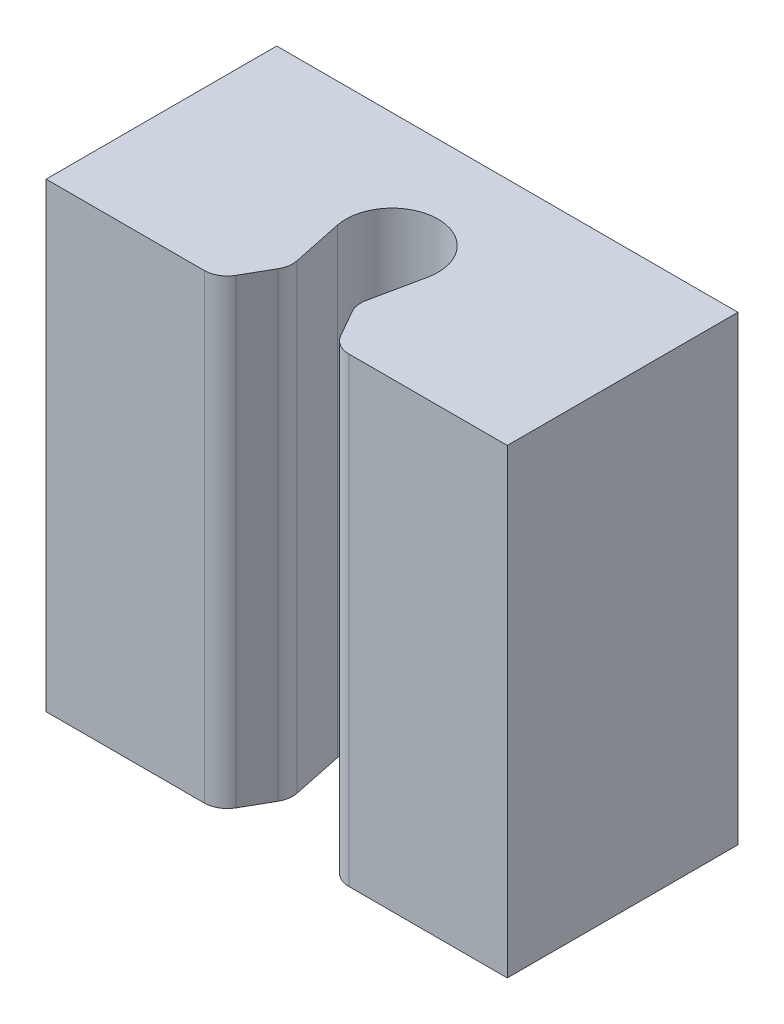
ISO-10303-21;
HEADER;
FILE_DESCRIPTION(('STEP AP214'),'2;1');
FILE_NAME('part.step','',(''),(''),'','','');
FILE_SCHEMA(('AUTOMOTIVE_DESIGN { 1 0 10303 214 1 1 1 1 }'));
ENDSEC;
DATA;
#1=APPLICATION_CONTEXT('core data for automotive mechanical design processes');
#2=APPLICATION_PROTOCOL_DEFINITION('international standard','automotive_design',2000,#1);
#3=PRODUCT_CONTEXT('',#1,'mechanical');
#4=PRODUCT('Part','Part','',(#3));
#5=PRODUCT_RELATED_PRODUCT_CATEGORY('part','',(#4));
#6=PRODUCT_DEFINITION_FORMATION('','',#4);
#7=PRODUCT_DEFINITION_CONTEXT('part definition',#1,'design');
#8=PRODUCT_DEFINITION('design','',#6,#7);
#9=PRODUCT_DEFINITION_SHAPE('','',#8);
#10=(LENGTH_UNIT() NAMED_UNIT(*) SI_UNIT(.MILLI.,.METRE.));
#11=(NAMED_UNIT(*) PLANE_ANGLE_UNIT() SI_UNIT($,.RADIAN.));
#12=(NAMED_UNIT(*) SI_UNIT($,.STERADIAN.) SOLID_ANGLE_UNIT());
#13=UNCERTAINTY_MEASURE_WITH_UNIT(LENGTH_MEASURE(1.E-05),#10,'distance_accuracy_value','');
#14=(GEOMETRIC_REPRESENTATION_CONTEXT(3) GLOBAL_UNCERTAINTY_ASSIGNED_CONTEXT((#13)) GLOBAL_UNIT_ASSIGNED_CONTEXT((#10,
#11,#12)) REPRESENTATION_CONTEXT('',''));
#15=CARTESIAN_POINT('',(0.,0.,0.));
#16=DIRECTION('',(0.,0.,1.));
#17=DIRECTION('',(1.,0.,0.));
#18=AXIS2_PLACEMENT_3D('',#15,#16,#17);
#19=CARTESIAN_POINT('',(50.,-50.,50.));
#20=DIRECTION('',(0.,1.,0.));
#21=DIRECTION('',(-1.,0.,0.));
#22=AXIS2_PLACEMENT_3D('',#19,#20,#21);
#23=PLANE('',#22);
#24=DIRECTION('',(1.,0.,0.));
#25=VECTOR('',#24,1.);
#26=CARTESIAN_POINT('',(50.,-50.,50.));
#27=LINE('',#26,#25);
#28=CARTESIAN_POINT('',(15.6943456664814,-50.,50.));
#29=VERTEX_POINT('',#28);
#30=CARTESIAN_POINT('',(50.,-50.,50.));
#31=VERTEX_POINT('',#30);
#32=EDGE_CURVE('E186',#29,#31,#27,.T.);
#33=ORIENTED_EDGE('',*,*,#32,.F.);
#34=CARTESIAN_POINT('',(15.6943456664814,-50.,45.));
#35=DIRECTION('',(0.,1.,0.));
#36=DIRECTION('',(-1.,0.,0.));
#37=AXIS2_PLACEMENT_3D('',#34,#35,#36);
#38=CIRCLE('',#37,5.);
#39=CARTESIAN_POINT('',(11.3512143479432,-50.,47.4773393691484));
#40=VERTEX_POINT('',#39);
#41=EDGE_CURVE('E225',#29,#40,#38,.F.);
#42=ORIENTED_EDGE('',*,*,#41,.T.);
#43=DIRECTION('',(-0.495467873829664,0.,-0.86862626370765));
#44=VECTOR('',#43,1.);
#45=CARTESIAN_POINT('',(-11.8685040398792,-50.,6.76984188467605));
#46=LINE('',#45,#44);
#47=CARTESIAN_POINT('',(8.0242982021265,-50.,41.6447780790033));
#48=VERTEX_POINT('',#47);
#49=EDGE_CURVE('E165',#40,#48,#46,.T.);
#50=ORIENTED_EDGE('',*,*,#49,.T.);
#51=CARTESIAN_POINT('',(12.3674295206647,-50.,39.167438709855));
#52=DIRECTION('',(0.,1.,0.));
#53=DIRECTION('',(-1.,0.,0.));
#54=AXIS2_PLACEMENT_3D('',#51,#52,#53);
#55=CIRCLE('',#54,5.);
#56=CARTESIAN_POINT('',(7.47279898237299,-50.,38.1463648175133));
#57=VERTEX_POINT('',#56);
#58=EDGE_CURVE('E223',#48,#57,#55,.F.);
#59=ORIENTED_EDGE('',*,*,#58,.T.);
#60=DIRECTION('',(0.20421477846833,0.,-0.978926107658352));
#61=VECTOR('',#60,1.);
#62=CARTESIAN_POINT('',(14.7870405318914,-50.,3.08473967830502));
#63=LINE('',#62,#61);
#64=CARTESIAN_POINT('',(9.78926107658353,-50.,27.0421477846833));
#65=VERTEX_POINT('',#64);
#66=EDGE_CURVE('E177',#57,#65,#63,.T.);
#67=ORIENTED_EDGE('',*,*,#66,.T.);
#68=CARTESIAN_POINT('',(0.,-50.,25.));
#69=DIRECTION('',(0.,-1.,0.));
#70=DIRECTION('',(1.,0.,0.));
#71=AXIS2_PLACEMENT_3D('',#68,#69,#70);
#72=CIRCLE('',#71,10.);
#73=CARTESIAN_POINT('',(-9.78926107658352,-50.,27.0421477846833));
#74=VERTEX_POINT('',#73);
#75=EDGE_CURVE('E175',#74,#65,#72,.T.);
#76=ORIENTED_EDGE('',*,*,#75,.F.);
#77=DIRECTION('',(0.20421477846833,0.,0.978926107658352));
#78=VECTOR('',#77,1.);
#79=CARTESIAN_POINT('',(-14.7870405318914,-50.,3.08473967830503));
#80=LINE('',#79,#78);
#81=CARTESIAN_POINT('',(-7.47279898237298,-50.,38.1463648175133));
#82=VERTEX_POINT('',#81);
#83=EDGE_CURVE('E146',#74,#82,#80,.T.);
#84=ORIENTED_EDGE('',*,*,#83,.T.);
#85=CARTESIAN_POINT('',(-12.3674295206647,-50.,39.167438709855));
#86=DIRECTION('',(0.,1.,0.));
#87=DIRECTION('',(-1.,0.,0.));
#88=AXIS2_PLACEMENT_3D('',#85,#86,#87);
#89=CIRCLE('',#88,5.);
#90=CARTESIAN_POINT('',(-8.02429820212648,-50.,41.6447780790033));
#91=VERTEX_POINT('',#90);
#92=EDGE_CURVE('E219',#82,#91,#89,.F.);
#93=ORIENTED_EDGE('',*,*,#92,.T.);
#94=DIRECTION('',(-0.495467873829664,0.,0.86862626370765));
#95=VECTOR('',#94,1.);
#96=CARTESIAN_POINT('',(11.8685040398792,-50.,6.76984188467604));
#97=LINE('',#96,#95);
#98=CARTESIAN_POINT('',(-11.3512143479431,-50.,47.4773393691483));
#99=VERTEX_POINT('',#98);
#100=EDGE_CURVE('E171',#91,#99,#97,.T.);
#101=ORIENTED_EDGE('',*,*,#100,.T.);
#102=CARTESIAN_POINT('',(-15.6943456664814,-50.,45.));
#103=DIRECTION('',(0.,1.,0.));
#104=DIRECTION('',(-1.,0.,0.));
#105=AXIS2_PLACEMENT_3D('',#102,#103,#104);
#106=CIRCLE('',#105,5.);
#107=CARTESIAN_POINT('',(-15.6943456664814,-50.,50.));
#108=VERTEX_POINT('',#107);
#109=EDGE_CURVE('E221',#99,#108,#106,.F.);
#110=ORIENTED_EDGE('',*,*,#109,.T.);
#111=CARTESIAN_POINT('',(-50.,-50.,50.));
#112=VERTEX_POINT('',#111);
#113=EDGE_CURVE('E188',#112,#108,#27,.T.);
#114=ORIENTED_EDGE('',*,*,#113,.F.);
#115=DIRECTION('',(0.,0.,-1.));
#116=VECTOR('',#115,1.);
#117=CARTESIAN_POINT('',(-50.,-50.,50.));
#118=LINE('',#117,#116);
#119=CARTESIAN_POINT('',(-50.,-50.,0.));
#120=VERTEX_POINT('',#119);
#121=EDGE_CURVE('E213',#112,#120,#118,.T.);
#122=ORIENTED_EDGE('',*,*,#121,.T.);
#123=DIRECTION('',(1.,0.,0.));
#124=VECTOR('',#123,1.);
#125=CARTESIAN_POINT('',(50.,-50.,0.));
#126=LINE('',#125,#124);
#127=CARTESIAN_POINT('',(50.,-50.,0.));
#128=VERTEX_POINT('',#127);
#129=EDGE_CURVE('E200',#120,#128,#126,.T.);
#130=ORIENTED_EDGE('',*,*,#129,.T.);
#131=DIRECTION('',(0.,0.,-1.));
#132=VECTOR('',#131,1.);
#133=CARTESIAN_POINT('',(50.,-50.,50.));
#134=LINE('',#133,#132);
#135=EDGE_CURVE('E210',#31,#128,#134,.T.);
#136=ORIENTED_EDGE('',*,*,#135,.F.);
#137=EDGE_LOOP('',(#33,#42,#50,#59,#67,#76,#84,#93,#101,#110,#114,#122,#130,#136));
#138=FACE_BOUND('',#137,.T.);
#139=ADVANCED_FACE('F37',(#138),#23,.F.);
#140=CARTESIAN_POINT('',(50.,50.,50.));
#141=DIRECTION('',(0.,-1.,0.));
#142=DIRECTION('',(1.,0.,0.));
#143=AXIS2_PLACEMENT_3D('',#140,#141,#142);
#144=PLANE('',#143);
#145=DIRECTION('',(-0.495467873829664,0.,-0.86862626370765));
#146=VECTOR('',#145,1.);
#147=CARTESIAN_POINT('',(-11.8685040398792,50.,6.76984188467605));
#148=LINE('',#147,#146);
#149=CARTESIAN_POINT('',(11.3512143479431,50.,47.4773393691484));
#150=VERTEX_POINT('',#149);
#151=CARTESIAN_POINT('',(8.02429820212648,50.,41.6447780790033));
#152=VERTEX_POINT('',#151);
#153=EDGE_CURVE('E151',#150,#152,#148,.T.);
#154=ORIENTED_EDGE('',*,*,#153,.F.);
#155=CARTESIAN_POINT('',(15.6943456664814,50.,45.));
#156=DIRECTION('',(0.,-1.,0.));
#157=DIRECTION('',(1.,0.,0.));
#158=AXIS2_PLACEMENT_3D('',#155,#156,#157);
#159=CIRCLE('',#158,5.);
#160=CARTESIAN_POINT('',(15.6943456664814,50.,50.));
#161=VERTEX_POINT('',#160);
#162=EDGE_CURVE('E237',#150,#161,#159,.F.);
#163=ORIENTED_EDGE('',*,*,#162,.T.);
#164=DIRECTION('',(-1.,0.,0.));
#165=VECTOR('',#164,1.);
#166=CARTESIAN_POINT('',(50.,50.,50.));
#167=LINE('',#166,#165);
#168=CARTESIAN_POINT('',(50.,50.,50.));
#169=VERTEX_POINT('',#168);
#170=EDGE_CURVE('E194',#169,#161,#167,.T.);
#171=ORIENTED_EDGE('',*,*,#170,.F.);
#172=DIRECTION('',(0.,0.,-1.));
#173=VECTOR('',#172,1.);
#174=CARTESIAN_POINT('',(50.,50.,50.));
#175=LINE('',#174,#173);
#176=CARTESIAN_POINT('',(50.,50.,0.));
#177=VERTEX_POINT('',#176);
#178=EDGE_CURVE('E207',#169,#177,#175,.T.);
#179=ORIENTED_EDGE('',*,*,#178,.T.);
#180=DIRECTION('',(-1.,0.,0.));
#181=VECTOR('',#180,1.);
#182=CARTESIAN_POINT('',(50.,50.,0.));
#183=LINE('',#182,#181);
#184=CARTESIAN_POINT('',(-50.,50.,0.));
#185=VERTEX_POINT('',#184);
#186=EDGE_CURVE('E187',#177,#185,#183,.T.);
#187=ORIENTED_EDGE('',*,*,#186,.T.);
#188=DIRECTION('',(0.,0.,-1.));
#189=VECTOR('',#188,1.);
#190=CARTESIAN_POINT('',(-50.,50.,50.));
#191=LINE('',#190,#189);
#192=CARTESIAN_POINT('',(-50.,50.,50.));
#193=VERTEX_POINT('',#192);
#194=EDGE_CURVE('E197',#193,#185,#191,.T.);
#195=ORIENTED_EDGE('',*,*,#194,.F.);
#196=CARTESIAN_POINT('',(-15.6943456664814,50.,50.));
#197=VERTEX_POINT('',#196);
#198=EDGE_CURVE('E193',#197,#193,#167,.T.);
#199=ORIENTED_EDGE('',*,*,#198,.F.);
#200=CARTESIAN_POINT('',(-15.6943456664814,50.,45.));
#201=DIRECTION('',(0.,-1.,0.));
#202=DIRECTION('',(1.,0.,0.));
#203=AXIS2_PLACEMENT_3D('',#200,#201,#202);
#204=CIRCLE('',#203,5.);
#205=CARTESIAN_POINT('',(-11.3512143479432,50.,47.4773393691483));
#206=VERTEX_POINT('',#205);
#207=EDGE_CURVE('E233',#197,#206,#204,.F.);
#208=ORIENTED_EDGE('',*,*,#207,.T.);
#209=DIRECTION('',(-0.495467873829664,0.,0.86862626370765));
#210=VECTOR('',#209,1.);
#211=CARTESIAN_POINT('',(11.8685040398792,50.,6.76984188467604));
#212=LINE('',#211,#210);
#213=CARTESIAN_POINT('',(-8.0242982021265,50.,41.6447780790033));
#214=VERTEX_POINT('',#213);
#215=EDGE_CURVE('E162',#214,#206,#212,.T.);
#216=ORIENTED_EDGE('',*,*,#215,.F.);
#217=CARTESIAN_POINT('',(-12.3674295206647,50.,39.167438709855));
#218=DIRECTION('',(0.,-1.,0.));
#219=DIRECTION('',(1.,0.,0.));
#220=AXIS2_PLACEMENT_3D('',#217,#218,#219);
#221=CIRCLE('',#220,5.);
#222=CARTESIAN_POINT('',(-7.47279898237299,50.,38.1463648175133));
#223=VERTEX_POINT('',#222);
#224=EDGE_CURVE('E60',#214,#223,#221,.F.);
#225=ORIENTED_EDGE('',*,*,#224,.T.);
#226=DIRECTION('',(0.20421477846833,0.,0.978926107658352));
#227=VECTOR('',#226,1.);
#228=CARTESIAN_POINT('',(-14.7870405318914,50.,3.08473967830503));
#229=LINE('',#228,#227);
#230=CARTESIAN_POINT('',(-9.78926107658353,50.,27.0421477846833));
#231=VERTEX_POINT('',#230);
#232=EDGE_CURVE('E143',#231,#223,#229,.T.);
#233=ORIENTED_EDGE('',*,*,#232,.F.);
#234=CARTESIAN_POINT('',(0.,50.,25.));
#235=DIRECTION('',(0.,-1.,0.));
#236=DIRECTION('',(1.,0.,0.));
#237=AXIS2_PLACEMENT_3D('',#234,#235,#236);
#238=CIRCLE('',#237,10.);
#239=CARTESIAN_POINT('',(9.78926107658352,50.,27.0421477846833));
#240=VERTEX_POINT('',#239);
#241=EDGE_CURVE('E155',#231,#240,#238,.T.);
#242=ORIENTED_EDGE('',*,*,#241,.T.);
#243=DIRECTION('',(0.20421477846833,0.,-0.978926107658352));
#244=VECTOR('',#243,1.);
#245=CARTESIAN_POINT('',(14.7870405318914,50.,3.08473967830502));
#246=LINE('',#245,#244);
#247=CARTESIAN_POINT('',(7.47279898237298,50.,38.1463648175133));
#248=VERTEX_POINT('',#247);
#249=EDGE_CURVE('E158',#248,#240,#246,.T.);
#250=ORIENTED_EDGE('',*,*,#249,.F.);
#251=CARTESIAN_POINT('',(12.3674295206647,50.,39.167438709855));
#252=DIRECTION('',(0.,-1.,0.));
#253=DIRECTION('',(1.,0.,0.));
#254=AXIS2_PLACEMENT_3D('',#251,#252,#253);
#255=CIRCLE('',#254,5.);
#256=EDGE_CURVE('E235',#248,#152,#255,.F.);
#257=ORIENTED_EDGE('',*,*,#256,.T.);
#258=EDGE_LOOP('',(#154,#163,#171,#179,#187,#195,#199,#208,#216,#225,#233,#242,#250,#257));
#259=FACE_BOUND('',#258,.T.);
#260=ADVANCED_FACE('F161',(#259),#144,.F.);
#261=CARTESIAN_POINT('',(0.,0.,50.));
#262=DIRECTION('',(0.,0.,-1.));
#263=DIRECTION('',(-1.,0.,0.));
#264=AXIS2_PLACEMENT_3D('',#261,#262,#263);
#265=PLANE('',#264);
#266=ORIENTED_EDGE('',*,*,#170,.T.);
#267=DIRECTION('',(0.,-1.,0.));
#268=VECTOR('',#267,1.);
#269=CARTESIAN_POINT('',(15.6943456664814,-50.,50.));
#270=LINE('',#269,#268);
#271=EDGE_CURVE('E216',#161,#29,#270,.T.);
#272=ORIENTED_EDGE('',*,*,#271,.T.);
#273=ORIENTED_EDGE('',*,*,#32,.T.);
#274=DIRECTION('',(0.,1.,0.));
#275=VECTOR('',#274,1.);
#276=CARTESIAN_POINT('',(50.,50.,50.));
#277=LINE('',#276,#275);
#278=EDGE_CURVE('E191',#31,#169,#277,.T.);
#279=ORIENTED_EDGE('',*,*,#278,.T.);
#280=EDGE_LOOP('',(#266,#272,#273,#279));
#281=FACE_BOUND('',#280,.T.);
#282=ADVANCED_FACE('F271',(#281),#265,.F.);
#283=ORIENTED_EDGE('',*,*,#113,.T.);
#284=DIRECTION('',(0.,-1.,0.));
#285=VECTOR('',#284,1.);
#286=CARTESIAN_POINT('',(-15.6943456664814,50.,50.));
#287=LINE('',#286,#285);
#288=EDGE_CURVE('E45',#108,#197,#287,.F.);
#289=ORIENTED_EDGE('',*,*,#288,.T.);
#290=ORIENTED_EDGE('',*,*,#198,.T.);
#291=DIRECTION('',(0.,-1.,0.));
#292=VECTOR('',#291,1.);
#293=CARTESIAN_POINT('',(-50.,50.,50.));
#294=LINE('',#293,#292);
#295=EDGE_CURVE('E183',#193,#112,#294,.T.);
#296=ORIENTED_EDGE('',*,*,#295,.T.);
#297=EDGE_LOOP('',(#283,#289,#290,#296));
#298=FACE_BOUND('',#297,.T.);
#299=ADVANCED_FACE('F247',(#298),#265,.F.);
#300=CARTESIAN_POINT('',(-50.,50.,50.));
#301=DIRECTION('',(1.,0.,0.));
#302=DIRECTION('',(0.,1.,0.));
#303=AXIS2_PLACEMENT_3D('',#300,#301,#302);
#304=PLANE('',#303);
#305=DIRECTION('',(0.,-1.,0.));
#306=VECTOR('',#305,1.);
#307=CARTESIAN_POINT('',(-50.,50.,0.));
#308=LINE('',#307,#306);
#309=EDGE_CURVE('E181',#185,#120,#308,.T.);
#310=ORIENTED_EDGE('',*,*,#309,.T.);
#311=ORIENTED_EDGE('',*,*,#121,.F.);
#312=ORIENTED_EDGE('',*,*,#295,.F.);
#313=ORIENTED_EDGE('',*,*,#194,.T.);
#314=EDGE_LOOP('',(#310,#311,#312,#313));
#315=FACE_BOUND('',#314,.T.);
#316=ADVANCED_FACE('F276',(#315),#304,.F.);
#317=CARTESIAN_POINT('',(50.,50.,50.));
#318=DIRECTION('',(-1.,0.,0.));
#319=DIRECTION('',(0.,-1.,0.));
#320=AXIS2_PLACEMENT_3D('',#317,#318,#319);
#321=PLANE('',#320);
#322=DIRECTION('',(0.,1.,0.));
#323=VECTOR('',#322,1.);
#324=CARTESIAN_POINT('',(50.,50.,0.));
#325=LINE('',#324,#323);
#326=EDGE_CURVE('E202',#128,#177,#325,.T.);
#327=ORIENTED_EDGE('',*,*,#326,.T.);
#328=ORIENTED_EDGE('',*,*,#178,.F.);
#329=ORIENTED_EDGE('',*,*,#278,.F.);
#330=ORIENTED_EDGE('',*,*,#135,.T.);
#331=EDGE_LOOP('',(#327,#328,#329,#330));
#332=FACE_BOUND('',#331,.T.);
#333=ADVANCED_FACE('F275',(#332),#321,.F.);
#334=CARTESIAN_POINT('',(0.,0.,0.));
#335=DIRECTION('',(0.,0.,-1.));
#336=DIRECTION('',(-1.,0.,0.));
#337=AXIS2_PLACEMENT_3D('',#334,#335,#336);
#338=PLANE('',#337);
#339=ORIENTED_EDGE('',*,*,#309,.F.);
#340=ORIENTED_EDGE('',*,*,#186,.F.);
#341=ORIENTED_EDGE('',*,*,#326,.F.);
#342=ORIENTED_EDGE('',*,*,#129,.F.);
#343=EDGE_LOOP('',(#339,#340,#341,#342));
#344=FACE_BOUND('',#343,.T.);
#345=ADVANCED_FACE('F306',(#344),#338,.T.);
#346=CARTESIAN_POINT('',(-11.8685040398792,50.,6.76984188467605));
#347=DIRECTION('',(-0.86862626370765,0.,0.495467873829664));
#348=DIRECTION('',(0.495467873829664,0.,0.86862626370765));
#349=AXIS2_PLACEMENT_3D('',#346,#347,#348);
#350=PLANE('',#349);
#351=ORIENTED_EDGE('',*,*,#49,.F.);
#352=DIRECTION('',(0.,-1.,0.));
#353=VECTOR('',#352,1.);
#354=CARTESIAN_POINT('',(11.3512143479431,50.,47.4773393691484));
#355=LINE('',#354,#353);
#356=EDGE_CURVE('E230',#40,#150,#355,.F.);
#357=ORIENTED_EDGE('',*,*,#356,.T.);
#358=ORIENTED_EDGE('',*,*,#153,.T.);
#359=DIRECTION('',(0.,-1.,0.));
#360=VECTOR('',#359,1.);
#361=CARTESIAN_POINT('',(8.02429820212648,50.,41.6447780790033));
#362=LINE('',#361,#360);
#363=EDGE_CURVE('E227',#152,#48,#362,.T.);
#364=ORIENTED_EDGE('',*,*,#363,.T.);
#365=EDGE_LOOP('',(#351,#357,#358,#364));
#366=FACE_BOUND('',#365,.T.);
#367=ADVANCED_FACE('F293',(#366),#350,.T.);
#368=CARTESIAN_POINT('',(14.7870405318914,50.,3.08473967830502));
#369=DIRECTION('',(-0.978926107658352,0.,-0.20421477846833));
#370=DIRECTION('',(-0.20421477846833,0.,0.978926107658352));
#371=AXIS2_PLACEMENT_3D('',#368,#369,#370);
#372=PLANE('',#371);
#373=ORIENTED_EDGE('',*,*,#66,.F.);
#374=DIRECTION('',(0.,-1.,0.));
#375=VECTOR('',#374,1.);
#376=CARTESIAN_POINT('',(7.47279898237298,50.,38.1463648175133));
#377=LINE('',#376,#375);
#378=EDGE_CURVE('E52',#57,#248,#377,.F.);
#379=ORIENTED_EDGE('',*,*,#378,.T.);
#380=ORIENTED_EDGE('',*,*,#249,.T.);
#381=DIRECTION('',(0.,-1.,0.));
#382=VECTOR('',#381,1.);
#383=CARTESIAN_POINT('',(9.78926107658352,50.,27.0421477846833));
#384=LINE('',#383,#382);
#385=EDGE_CURVE('E150',#240,#65,#384,.T.);
#386=ORIENTED_EDGE('',*,*,#385,.T.);
#387=EDGE_LOOP('',(#373,#379,#380,#386));
#388=FACE_BOUND('',#387,.T.);
#389=ADVANCED_FACE('F308',(#388),#372,.T.);
#390=CARTESIAN_POINT('',(0.,50.,25.));
#391=DIRECTION('',(0.,-1.,0.));
#392=DIRECTION('',(1.,0.,0.));
#393=AXIS2_PLACEMENT_3D('',#390,#391,#392);
#394=CYLINDRICAL_SURFACE('',#393,10.);
#395=ORIENTED_EDGE('',*,*,#75,.T.);
#396=ORIENTED_EDGE('',*,*,#385,.F.);
#397=ORIENTED_EDGE('',*,*,#241,.F.);
#398=DIRECTION('',(0.,-1.,0.));
#399=VECTOR('',#398,1.);
#400=CARTESIAN_POINT('',(-9.78926107658353,50.,27.0421477846833));
#401=LINE('',#400,#399);
#402=EDGE_CURVE('E140',#231,#74,#401,.T.);
#403=ORIENTED_EDGE('',*,*,#402,.T.);
#404=EDGE_LOOP('',(#395,#396,#397,#403));
#405=FACE_BOUND('',#404,.T.);
#406=ADVANCED_FACE('F156',(#405),#394,.F.);
#407=CARTESIAN_POINT('',(-14.7870405318914,50.,3.08473967830503));
#408=DIRECTION('',(0.978926107658352,0.,-0.20421477846833));
#409=DIRECTION('',(-0.20421477846833,0.,-0.978926107658352));
#410=AXIS2_PLACEMENT_3D('',#407,#408,#409);
#411=PLANE('',#410);
#412=ORIENTED_EDGE('',*,*,#232,.T.);
#413=DIRECTION('',(0.,-1.,0.));
#414=VECTOR('',#413,1.);
#415=CARTESIAN_POINT('',(-7.47279898237299,50.,38.1463648175133));
#416=LINE('',#415,#414);
#417=EDGE_CURVE('E11',#223,#82,#416,.T.);
#418=ORIENTED_EDGE('',*,*,#417,.T.);
#419=ORIENTED_EDGE('',*,*,#83,.F.);
#420=ORIENTED_EDGE('',*,*,#402,.F.);
#421=EDGE_LOOP('',(#412,#418,#419,#420));
#422=FACE_BOUND('',#421,.T.);
#423=ADVANCED_FACE('F142',(#422),#411,.T.);
#424=CARTESIAN_POINT('',(11.8685040398792,50.,6.76984188467604));
#425=DIRECTION('',(0.86862626370765,0.,0.495467873829664));
#426=DIRECTION('',(0.495467873829664,0.,-0.86862626370765));
#427=AXIS2_PLACEMENT_3D('',#424,#425,#426);
#428=PLANE('',#427);
#429=ORIENTED_EDGE('',*,*,#215,.T.);
#430=DIRECTION('',(0.,-1.,0.));
#431=VECTOR('',#430,1.);
#432=CARTESIAN_POINT('',(-11.3512143479431,-50.,47.4773393691483));
#433=LINE('',#432,#431);
#434=EDGE_CURVE('E242',#206,#99,#433,.T.);
#435=ORIENTED_EDGE('',*,*,#434,.T.);
#436=ORIENTED_EDGE('',*,*,#100,.F.);
#437=DIRECTION('',(0.,-1.,0.));
#438=VECTOR('',#437,1.);
#439=CARTESIAN_POINT('',(-8.0242982021265,50.,41.6447780790033));
#440=LINE('',#439,#438);
#441=EDGE_CURVE('E240',#91,#214,#440,.F.);
#442=ORIENTED_EDGE('',*,*,#441,.T.);
#443=EDGE_LOOP('',(#429,#435,#436,#442));
#444=FACE_BOUND('',#443,.T.);
#445=ADVANCED_FACE('F256',(#444),#428,.T.);
#446=CARTESIAN_POINT('',(15.6943456664814,0.,45.));
#447=DIRECTION('',(0.,1.,0.));
#448=DIRECTION('',(-1.,0.,0.));
#449=AXIS2_PLACEMENT_3D('',#446,#447,#448);
#450=CYLINDRICAL_SURFACE('',#449,5.);
#451=ORIENTED_EDGE('',*,*,#162,.F.);
#452=ORIENTED_EDGE('',*,*,#356,.F.);
#453=ORIENTED_EDGE('',*,*,#41,.F.);
#454=ORIENTED_EDGE('',*,*,#271,.F.);
#455=EDGE_LOOP('',(#451,#452,#453,#454));
#456=FACE_BOUND('',#455,.T.);
#457=ADVANCED_FACE('F280',(#456),#450,.T.);
#458=CARTESIAN_POINT('',(12.3674295206647,50.,39.167438709855));
#459=DIRECTION('',(0.,-1.,0.));
#460=DIRECTION('',(1.,0.,0.));
#461=AXIS2_PLACEMENT_3D('',#458,#459,#460);
#462=CYLINDRICAL_SURFACE('',#461,5.);
#463=ORIENTED_EDGE('',*,*,#256,.F.);
#464=ORIENTED_EDGE('',*,*,#378,.F.);
#465=ORIENTED_EDGE('',*,*,#58,.F.);
#466=ORIENTED_EDGE('',*,*,#363,.F.);
#467=EDGE_LOOP('',(#463,#464,#465,#466));
#468=FACE_BOUND('',#467,.T.);
#469=ADVANCED_FACE('F265',(#468),#462,.T.);
#470=CARTESIAN_POINT('',(-15.6943456664814,50.,45.));
#471=DIRECTION('',(0.,1.,0.));
#472=DIRECTION('',(-1.,0.,0.));
#473=AXIS2_PLACEMENT_3D('',#470,#471,#472);
#474=CYLINDRICAL_SURFACE('',#473,5.);
#475=ORIENTED_EDGE('',*,*,#207,.F.);
#476=ORIENTED_EDGE('',*,*,#288,.F.);
#477=ORIENTED_EDGE('',*,*,#109,.F.);
#478=ORIENTED_EDGE('',*,*,#434,.F.);
#479=EDGE_LOOP('',(#475,#476,#477,#478));
#480=FACE_BOUND('',#479,.T.);
#481=ADVANCED_FACE('F253',(#480),#474,.T.);
#482=CARTESIAN_POINT('',(-12.3674295206647,50.,39.167438709855));
#483=DIRECTION('',(0.,-1.,0.));
#484=DIRECTION('',(1.,0.,0.));
#485=AXIS2_PLACEMENT_3D('',#482,#483,#484);
#486=CYLINDRICAL_SURFACE('',#485,5.);
#487=ORIENTED_EDGE('',*,*,#224,.F.);
#488=ORIENTED_EDGE('',*,*,#441,.F.);
#489=ORIENTED_EDGE('',*,*,#92,.F.);
#490=ORIENTED_EDGE('',*,*,#417,.F.);
#491=EDGE_LOOP('',(#487,#488,#489,#490));
#492=FACE_BOUND('',#491,.T.);
#493=ADVANCED_FACE('F39',(#492),#486,.T.);
#494=CLOSED_SHELL('',(#139,#260,#282,#299,#316,#333,#345,#367,#389,#406,#423,#445,#457,#469,
#481,#493));
#495=MANIFOLD_SOLID_BREP('B2',#494);
#496=ADVANCED_BREP_SHAPE_REPRESENTATION('',(#18,#495),#14);
#497=SHAPE_DEFINITION_REPRESENTATION(#9,#496);
ENDSEC;
END-ISO-10303-21;
